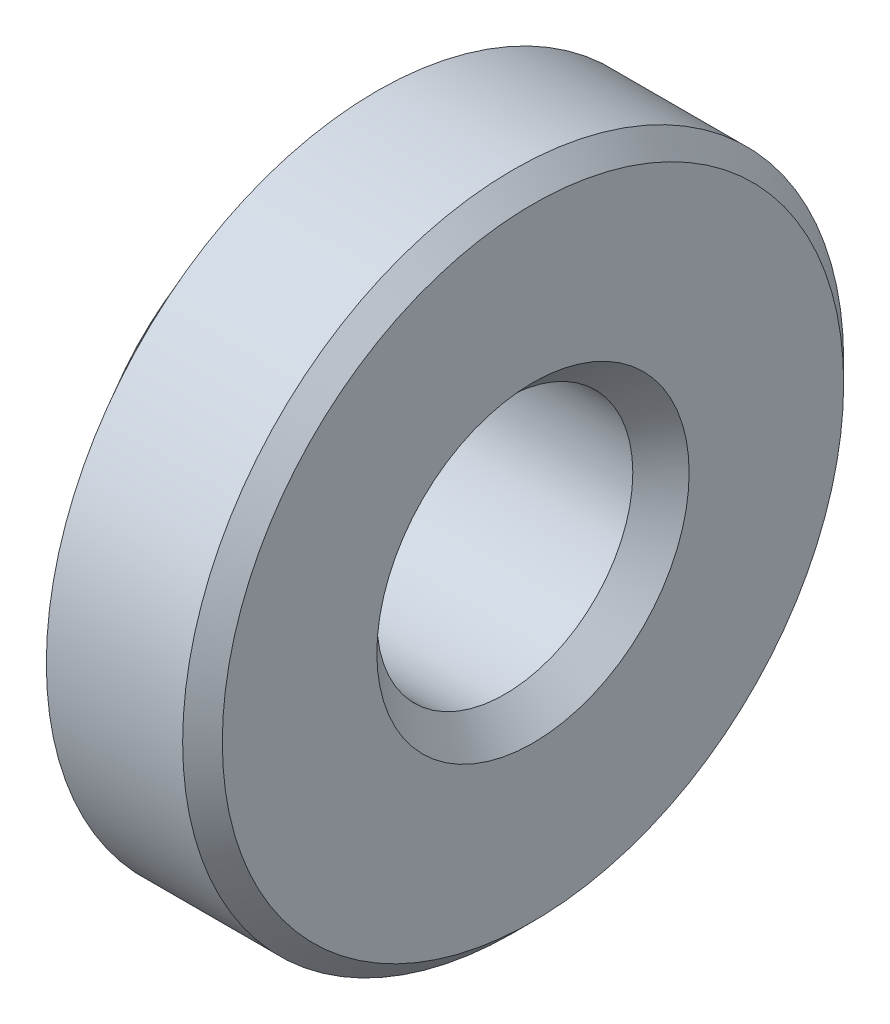
ISO-10303-21;
HEADER;
FILE_DESCRIPTION(('STEP AP214'),'2;1');
FILE_NAME('part.step','',(''),(''),'','','');
FILE_SCHEMA(('AUTOMOTIVE_DESIGN { 1 0 10303 214 1 1 1 1 }'));
ENDSEC;
DATA;
#1=APPLICATION_CONTEXT('core data for automotive mechanical design processes');
#2=APPLICATION_PROTOCOL_DEFINITION('international standard','automotive_design',2000,#1);
#3=PRODUCT_CONTEXT('',#1,'mechanical');
#4=PRODUCT('Part','Part','',(#3));
#5=PRODUCT_RELATED_PRODUCT_CATEGORY('part','',(#4));
#6=PRODUCT_DEFINITION_FORMATION('','',#4);
#7=PRODUCT_DEFINITION_CONTEXT('part definition',#1,'design');
#8=PRODUCT_DEFINITION('design','',#6,#7);
#9=PRODUCT_DEFINITION_SHAPE('','',#8);
#10=(LENGTH_UNIT() NAMED_UNIT(*) SI_UNIT(.MILLI.,.METRE.));
#11=(NAMED_UNIT(*) PLANE_ANGLE_UNIT() SI_UNIT($,.RADIAN.));
#12=(NAMED_UNIT(*) SI_UNIT($,.STERADIAN.) SOLID_ANGLE_UNIT());
#13=UNCERTAINTY_MEASURE_WITH_UNIT(LENGTH_MEASURE(1.E-05),#10,'distance_accuracy_value','');
#14=(GEOMETRIC_REPRESENTATION_CONTEXT(3) GLOBAL_UNCERTAINTY_ASSIGNED_CONTEXT((#13)) GLOBAL_UNIT_ASSIGNED_CONTEXT((#10,
#11,#12)) REPRESENTATION_CONTEXT('',''));
#15=CARTESIAN_POINT('',(0.,0.,0.));
#16=DIRECTION('',(0.,0.,1.));
#17=DIRECTION('',(1.,0.,0.));
#18=AXIS2_PLACEMENT_3D('',#15,#16,#17);
#19=CARTESIAN_POINT('',(0.17769230769231,0.,0.));
#20=DIRECTION('',(-1.,0.,0.));
#21=DIRECTION('',(0.,0.,1.));
#22=AXIS2_PLACEMENT_3D('',#19,#20,#21);
#23=CYLINDRICAL_SURFACE('',#22,2.1);
#24=CARTESIAN_POINT('',(0.17769230769231,0.,0.));
#25=DIRECTION('',(1.,0.,0.));
#26=DIRECTION('',(0.,0.,-1.));
#27=AXIS2_PLACEMENT_3D('',#24,#25,#26);
#28=CIRCLE('',#27,2.1);
#29=CARTESIAN_POINT('',(0.17769230769231,0.,-2.09999999999996));
#30=VERTEX_POINT('',#29);
#31=EDGE_CURVE('E31',#30,#30,#28,.T.);
#32=ORIENTED_EDGE('',*,*,#31,.F.);
#33=EDGE_LOOP('',(#32));
#34=FACE_BOUND('',#33,.T.);
#35=CARTESIAN_POINT('',(0.,0.,0.));
#36=DIRECTION('',(-1.,0.,0.));
#37=DIRECTION('',(0.,0.,1.));
#38=AXIS2_PLACEMENT_3D('',#35,#36,#37);
#39=CIRCLE('',#38,2.1);
#40=CARTESIAN_POINT('',(0.,0.,2.10000000000004));
#41=VERTEX_POINT('',#40);
#42=EDGE_CURVE('E18',#41,#41,#39,.T.);
#43=ORIENTED_EDGE('',*,*,#42,.F.);
#44=EDGE_LOOP('',(#43));
#45=FACE_BOUND('',#44,.T.);
#46=ADVANCED_FACE('F14',(#34,#45),#23,.T.);
#47=CARTESIAN_POINT('',(0.385,0.,0.));
#48=DIRECTION('',(-1.,0.,0.));
#49=DIRECTION('',(0.,0.,1.));
#50=AXIS2_PLACEMENT_3D('',#47,#48,#49);
#51=CONICAL_SURFACE('',#50,2.06500000000004,0.167253937462264);
#52=ORIENTED_EDGE('',*,*,#31,.T.);
#53=EDGE_LOOP('',(#52));
#54=FACE_BOUND('',#53,.T.);
#55=CARTESIAN_POINT('',(0.385,0.,0.));
#56=DIRECTION('',(-1.,0.,0.));
#57=DIRECTION('',(0.,0.,1.));
#58=AXIS2_PLACEMENT_3D('',#55,#56,#57);
#59=CIRCLE('',#58,2.06500000000004);
#60=CARTESIAN_POINT('',(0.385,0.,2.06500000000008));
#61=VERTEX_POINT('',#60);
#62=EDGE_CURVE('E48',#61,#61,#59,.F.);
#63=ORIENTED_EDGE('',*,*,#62,.F.);
#64=EDGE_LOOP('',(#63));
#65=FACE_BOUND('',#64,.T.);
#66=ADVANCED_FACE('F58',(#54,#65),#51,.T.);
#67=CARTESIAN_POINT('',(0.,-2.142,-2.1));
#68=DIRECTION('',(-1.,0.,0.));
#69=DIRECTION('',(0.,0.,1.));
#70=AXIS2_PLACEMENT_3D('',#67,#68,#69);
#71=PLANE('',#70);
#72=ORIENTED_EDGE('',*,*,#42,.T.);
#73=EDGE_LOOP('',(#72));
#74=FACE_BOUND('',#73,.T.);
#75=CARTESIAN_POINT('',(0.,0.,0.));
#76=DIRECTION('',(-1.,0.,0.));
#77=DIRECTION('',(0.,0.,1.));
#78=AXIS2_PLACEMENT_3D('',#75,#76,#77);
#79=CIRCLE('',#78,1.5);
#80=CARTESIAN_POINT('',(0.,0.,1.5));
#81=VERTEX_POINT('',#80);
#82=EDGE_CURVE('E46',#81,#81,#79,.T.);
#83=ORIENTED_EDGE('',*,*,#82,.F.);
#84=EDGE_LOOP('',(#83));
#85=FACE_BOUND('',#84,.T.);
#86=ADVANCED_FACE('F68',(#74,#85),#71,.T.);
#87=CARTESIAN_POINT('',(0.385,-2.69025,-2.6375));
#88=DIRECTION('',(-1.,0.,0.));
#89=DIRECTION('',(0.,0.,1.));
#90=AXIS2_PLACEMENT_3D('',#87,#88,#89);
#91=PLANE('',#90);
#92=CARTESIAN_POINT('',(0.385,0.,0.));
#93=DIRECTION('',(1.,0.,0.));
#94=DIRECTION('',(0.,0.,-1.));
#95=AXIS2_PLACEMENT_3D('',#92,#93,#94);
#96=CIRCLE('',#95,2.6375);
#97=CARTESIAN_POINT('',(0.385,0.,-2.6375));
#98=VERTEX_POINT('',#97);
#99=EDGE_CURVE('E43',#98,#98,#96,.T.);
#100=ORIENTED_EDGE('',*,*,#99,.F.);
#101=EDGE_LOOP('',(#100));
#102=FACE_BOUND('',#101,.T.);
#103=ORIENTED_EDGE('',*,*,#62,.T.);
#104=EDGE_LOOP('',(#103));
#105=FACE_BOUND('',#104,.T.);
#106=ADVANCED_FACE('F100',(#102,#105),#91,.T.);
#107=CARTESIAN_POINT('',(0.2705,0.,0.));
#108=DIRECTION('',(-1.,0.,0.));
#109=DIRECTION('',(0.,0.,1.));
#110=AXIS2_PLACEMENT_3D('',#107,#108,#109);
#111=CONICAL_SURFACE('',#110,1.2295,0.785398163397449);
#112=ORIENTED_EDGE('',*,*,#82,.T.);
#113=EDGE_LOOP('',(#112));
#114=FACE_BOUND('',#113,.T.);
#115=CARTESIAN_POINT('',(0.2705,0.,0.));
#116=DIRECTION('',(-1.,0.,0.));
#117=DIRECTION('',(0.,0.,1.));
#118=AXIS2_PLACEMENT_3D('',#115,#116,#117);
#119=CIRCLE('',#118,1.2295);
#120=CARTESIAN_POINT('',(0.2705,0.,1.2295));
#121=VERTEX_POINT('',#120);
#122=EDGE_CURVE('E42',#121,#121,#119,.T.);
#123=ORIENTED_EDGE('',*,*,#122,.F.);
#124=EDGE_LOOP('',(#123));
#125=FACE_BOUND('',#124,.T.);
#126=ADVANCED_FACE('F96',(#114,#125),#111,.F.);
#127=CARTESIAN_POINT('',(0.385,0.,0.));
#128=DIRECTION('',(1.,0.,0.));
#129=DIRECTION('',(0.,0.,-1.));
#130=AXIS2_PLACEMENT_3D('',#127,#128,#129);
#131=CYLINDRICAL_SURFACE('',#130,2.6375);
#132=CARTESIAN_POINT('',(0.77,0.,0.));
#133=DIRECTION('',(1.,0.,0.));
#134=DIRECTION('',(0.,0.,-1.));
#135=AXIS2_PLACEMENT_3D('',#132,#133,#134);
#136=CIRCLE('',#135,2.6375);
#137=CARTESIAN_POINT('',(0.77,0.,-2.6375));
#138=VERTEX_POINT('',#137);
#139=EDGE_CURVE('E39',#138,#138,#136,.T.);
#140=ORIENTED_EDGE('',*,*,#139,.F.);
#141=EDGE_LOOP('',(#140));
#142=FACE_BOUND('',#141,.T.);
#143=ORIENTED_EDGE('',*,*,#99,.T.);
#144=EDGE_LOOP('',(#143));
#145=FACE_BOUND('',#144,.T.);
#146=ADVANCED_FACE('F93',(#142,#145),#131,.T.);
#147=CARTESIAN_POINT('',(1.9995,0.,0.));
#148=DIRECTION('',(-1.,0.,0.));
#149=DIRECTION('',(0.,0.,1.));
#150=AXIS2_PLACEMENT_3D('',#147,#148,#149);
#151=CYLINDRICAL_SURFACE('',#150,1.2295);
#152=ORIENTED_EDGE('',*,*,#122,.T.);
#153=EDGE_LOOP('',(#152));
#154=FACE_BOUND('',#153,.T.);
#155=CARTESIAN_POINT('',(1.9995,0.,0.));
#156=DIRECTION('',(-1.,0.,0.));
#157=DIRECTION('',(0.,0.,1.));
#158=AXIS2_PLACEMENT_3D('',#155,#156,#157);
#159=CIRCLE('',#158,1.2295);
#160=CARTESIAN_POINT('',(1.9995,0.,1.2295));
#161=VERTEX_POINT('',#160);
#162=EDGE_CURVE('E38',#161,#161,#159,.T.);
#163=ORIENTED_EDGE('',*,*,#162,.F.);
#164=EDGE_LOOP('',(#163));
#165=FACE_BOUND('',#164,.T.);
#166=ADVANCED_FACE('F89',(#154,#165),#151,.F.);
#167=CARTESIAN_POINT('',(0.77,-3.2385,-3.175));
#168=DIRECTION('',(-1.,0.,0.));
#169=DIRECTION('',(0.,0.,1.));
#170=AXIS2_PLACEMENT_3D('',#167,#168,#169);
#171=PLANE('',#170);
#172=CARTESIAN_POINT('',(0.77,0.,0.));
#173=DIRECTION('',(-1.,0.,0.));
#174=DIRECTION('',(0.,0.,1.));
#175=AXIS2_PLACEMENT_3D('',#172,#173,#174);
#176=CIRCLE('',#175,3.175);
#177=CARTESIAN_POINT('',(0.77,0.,3.17500000000002));
#178=VERTEX_POINT('',#177);
#179=EDGE_CURVE('E35',#178,#178,#176,.F.);
#180=ORIENTED_EDGE('',*,*,#179,.F.);
#181=EDGE_LOOP('',(#180));
#182=FACE_BOUND('',#181,.T.);
#183=ORIENTED_EDGE('',*,*,#139,.T.);
#184=EDGE_LOOP('',(#183));
#185=FACE_BOUND('',#184,.T.);
#186=ADVANCED_FACE('F86',(#182,#185),#171,.T.);
#187=CARTESIAN_POINT('',(2.27,0.,0.));
#188=DIRECTION('',(1.,0.,0.));
#189=DIRECTION('',(0.,0.,-1.));
#190=AXIS2_PLACEMENT_3D('',#187,#188,#189);
#191=CONICAL_SURFACE('',#190,1.5,0.785398163397449);
#192=ORIENTED_EDGE('',*,*,#162,.T.);
#193=EDGE_LOOP('',(#192));
#194=FACE_BOUND('',#193,.T.);
#195=CARTESIAN_POINT('',(2.27,0.,0.));
#196=DIRECTION('',(1.,0.,0.));
#197=DIRECTION('',(0.,0.,-1.));
#198=AXIS2_PLACEMENT_3D('',#195,#196,#197);
#199=CIRCLE('',#198,1.5);
#200=CARTESIAN_POINT('',(2.27,0.,-1.5));
#201=VERTEX_POINT('',#200);
#202=EDGE_CURVE('E27',#201,#201,#199,.F.);
#203=ORIENTED_EDGE('',*,*,#202,.F.);
#204=EDGE_LOOP('',(#203));
#205=FACE_BOUND('',#204,.T.);
#206=ADVANCED_FACE('F82',(#194,#205),#191,.F.);
#207=CARTESIAN_POINT('',(2.0795,0.,0.));
#208=DIRECTION('',(-1.,0.,0.));
#209=DIRECTION('',(0.,0.,1.));
#210=AXIS2_PLACEMENT_3D('',#207,#208,#209);
#211=CYLINDRICAL_SURFACE('',#210,3.175);
#212=CARTESIAN_POINT('',(2.0795,0.,0.));
#213=DIRECTION('',(1.,0.,0.));
#214=DIRECTION('',(0.,0.,-1.));
#215=AXIS2_PLACEMENT_3D('',#212,#213,#214);
#216=CIRCLE('',#215,3.175);
#217=CARTESIAN_POINT('',(2.0795,0.,-3.17499999999998));
#218=VERTEX_POINT('',#217);
#219=EDGE_CURVE('E22',#218,#218,#216,.T.);
#220=ORIENTED_EDGE('',*,*,#219,.F.);
#221=EDGE_LOOP('',(#220));
#222=FACE_BOUND('',#221,.T.);
#223=ORIENTED_EDGE('',*,*,#179,.T.);
#224=EDGE_LOOP('',(#223));
#225=FACE_BOUND('',#224,.T.);
#226=ADVANCED_FACE('F75',(#222,#225),#211,.T.);
#227=CARTESIAN_POINT('',(2.27,-3.04419,2.9845));
#228=DIRECTION('',(1.,0.,0.));
#229=DIRECTION('',(0.,0.,-1.));
#230=AXIS2_PLACEMENT_3D('',#227,#228,#229);
#231=PLANE('',#230);
#232=CARTESIAN_POINT('',(2.27,0.,0.));
#233=DIRECTION('',(-1.,0.,0.));
#234=DIRECTION('',(0.,0.,1.));
#235=AXIS2_PLACEMENT_3D('',#232,#233,#234);
#236=CIRCLE('',#235,2.98450000000001);
#237=CARTESIAN_POINT('',(2.27,0.,2.98450000000003));
#238=VERTEX_POINT('',#237);
#239=EDGE_CURVE('E9',#238,#238,#236,.T.);
#240=ORIENTED_EDGE('',*,*,#239,.F.);
#241=EDGE_LOOP('',(#240));
#242=FACE_BOUND('',#241,.T.);
#243=ORIENTED_EDGE('',*,*,#202,.T.);
#244=EDGE_LOOP('',(#243));
#245=FACE_BOUND('',#244,.T.);
#246=ADVANCED_FACE('F71',(#242,#245),#231,.T.);
#247=CARTESIAN_POINT('',(2.27,0.,0.));
#248=DIRECTION('',(-1.,0.,0.));
#249=DIRECTION('',(0.,0.,1.));
#250=AXIS2_PLACEMENT_3D('',#247,#248,#249);
#251=CONICAL_SURFACE('',#250,2.98450000000001,0.785398163397447);
#252=ORIENTED_EDGE('',*,*,#239,.T.);
#253=EDGE_LOOP('',(#252));
#254=FACE_BOUND('',#253,.T.);
#255=ORIENTED_EDGE('',*,*,#219,.T.);
#256=EDGE_LOOP('',(#255));
#257=FACE_BOUND('',#256,.T.);
#258=ADVANCED_FACE('F16',(#254,#257),#251,.T.);
#259=CLOSED_SHELL('',(#46,#66,#86,#106,#126,#146,#166,#186,#206,#226,#246,#258));
#260=MANIFOLD_SOLID_BREP('B1',#259);
#261=ADVANCED_BREP_SHAPE_REPRESENTATION('',(#18,#260),#14);
#262=SHAPE_DEFINITION_REPRESENTATION(#9,#261);
ENDSEC;
END-ISO-10303-21;
